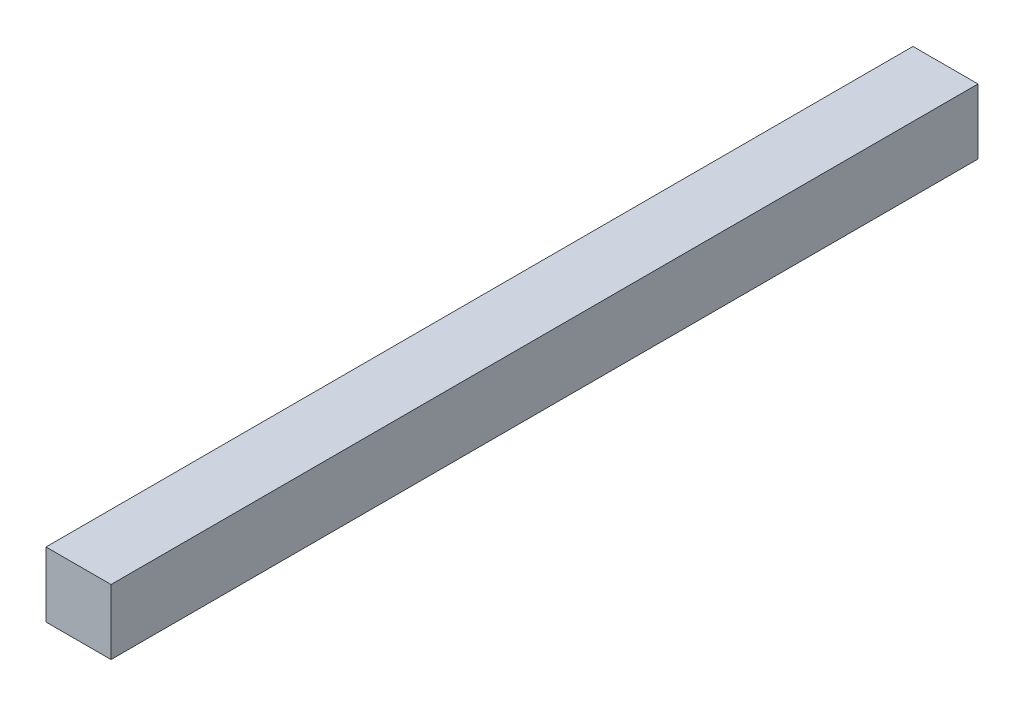
ISO-10303-21;
HEADER;
FILE_DESCRIPTION(('STEP AP214'),'2;1');
FILE_NAME('part.step','',(''),(''),'','','');
FILE_SCHEMA(('AUTOMOTIVE_DESIGN { 1 0 10303 214 1 1 1 1 }'));
ENDSEC;
DATA;
#1=APPLICATION_CONTEXT('core data for automotive mechanical design processes');
#2=APPLICATION_PROTOCOL_DEFINITION('international standard','automotive_design',2000,#1);
#3=PRODUCT_CONTEXT('',#1,'mechanical');
#4=PRODUCT('Part','Part','',(#3));
#5=PRODUCT_RELATED_PRODUCT_CATEGORY('part','',(#4));
#6=PRODUCT_DEFINITION_FORMATION('','',#4);
#7=PRODUCT_DEFINITION_CONTEXT('part definition',#1,'design');
#8=PRODUCT_DEFINITION('design','',#6,#7);
#9=PRODUCT_DEFINITION_SHAPE('','',#8);
#10=(LENGTH_UNIT() NAMED_UNIT(*) SI_UNIT(.MILLI.,.METRE.));
#11=(NAMED_UNIT(*) PLANE_ANGLE_UNIT() SI_UNIT($,.RADIAN.));
#12=(NAMED_UNIT(*) SI_UNIT($,.STERADIAN.) SOLID_ANGLE_UNIT());
#13=UNCERTAINTY_MEASURE_WITH_UNIT(LENGTH_MEASURE(1.E-05),#10,'distance_accuracy_value','');
#14=(GEOMETRIC_REPRESENTATION_CONTEXT(3) GLOBAL_UNCERTAINTY_ASSIGNED_CONTEXT((#13)) GLOBAL_UNIT_ASSIGNED_CONTEXT((#10,
#11,#12)) REPRESENTATION_CONTEXT('',''));
#15=CARTESIAN_POINT('',(0.,0.,0.));
#16=DIRECTION('',(0.,0.,1.));
#17=DIRECTION('',(1.,0.,0.));
#18=AXIS2_PLACEMENT_3D('',#15,#16,#17);
#19=CARTESIAN_POINT('',(64.6371308016878,-0.0100000000000031,7.15189873417722));
#20=DIRECTION('',(0.,0.,1.));
#21=DIRECTION('',(1.,0.,0.));
#22=AXIS2_PLACEMENT_3D('',#19,#20,#21);
#23=PLANE('',#22);
#24=DIRECTION('',(0.,1.,0.));
#25=VECTOR('',#24,1.);
#26=CARTESIAN_POINT('',(64.6371308016878,-0.0100000000000031,7.15189873417722));
#27=LINE('',#26,#25);
#28=CARTESIAN_POINT('',(64.6371308016878,0.,7.15189873417722));
#29=VERTEX_POINT('',#28);
#30=CARTESIAN_POINT('',(64.6371308016878,3.,7.15189873417722));
#31=VERTEX_POINT('',#30);
#32=EDGE_CURVE('E36',#29,#31,#27,.T.);
#33=ORIENTED_EDGE('',*,*,#32,.F.);
#34=DIRECTION('',(1.,0.,0.));
#35=VECTOR('',#34,1.);
#36=CARTESIAN_POINT('',(0.,0.,7.15189873417722));
#37=LINE('',#36,#35);
#38=CARTESIAN_POINT('',(67.6371308016878,0.,7.15189873417722));
#39=VERTEX_POINT('',#38);
#40=EDGE_CURVE('E87',#29,#39,#37,.T.);
#41=ORIENTED_EDGE('',*,*,#40,.T.);
#42=DIRECTION('',(0.,1.,0.));
#43=VECTOR('',#42,1.);
#44=CARTESIAN_POINT('',(67.6371308016878,-0.0100000000000031,7.15189873417722));
#45=LINE('',#44,#43);
#46=CARTESIAN_POINT('',(67.6371308016878,3.,7.15189873417722));
#47=VERTEX_POINT('',#46);
#48=EDGE_CURVE('E93',#39,#47,#45,.T.);
#49=ORIENTED_EDGE('',*,*,#48,.T.);
#50=DIRECTION('',(1.,0.,0.));
#51=VECTOR('',#50,1.);
#52=CARTESIAN_POINT('',(0.,3.,7.15189873417722));
#53=LINE('',#52,#51);
#54=EDGE_CURVE('E98',#31,#47,#53,.T.);
#55=ORIENTED_EDGE('',*,*,#54,.F.);
#56=EDGE_LOOP('',(#33,#41,#49,#55));
#57=FACE_BOUND('',#56,.T.);
#58=ADVANCED_FACE('F32',(#57),#23,.T.);
#59=CARTESIAN_POINT('',(64.6371308016878,-0.0100000000000031,-32.8481012658228));
#60=DIRECTION('',(0.,0.,-1.));
#61=DIRECTION('',(-1.,0.,0.));
#62=AXIS2_PLACEMENT_3D('',#59,#60,#61);
#63=PLANE('',#62);
#64=DIRECTION('',(0.,-1.,0.));
#65=VECTOR('',#64,1.);
#66=CARTESIAN_POINT('',(67.6371308016878,50.,-32.8481012658228));
#67=LINE('',#66,#65);
#68=CARTESIAN_POINT('',(67.6371308016878,3.,-32.8481012658228));
#69=VERTEX_POINT('',#68);
#70=CARTESIAN_POINT('',(67.6371308016878,0.,-32.8481012658228));
#71=VERTEX_POINT('',#70);
#72=EDGE_CURVE('E84',#69,#71,#67,.T.);
#73=ORIENTED_EDGE('',*,*,#72,.T.);
#74=DIRECTION('',(-1.,0.,0.));
#75=VECTOR('',#74,1.);
#76=CARTESIAN_POINT('',(0.,0.,-32.8481012658228));
#77=LINE('',#76,#75);
#78=CARTESIAN_POINT('',(64.6371308016878,0.,-32.8481012658228));
#79=VERTEX_POINT('',#78);
#80=EDGE_CURVE('E11',#71,#79,#77,.T.);
#81=ORIENTED_EDGE('',*,*,#80,.T.);
#82=DIRECTION('',(0.,1.,0.));
#83=VECTOR('',#82,1.);
#84=CARTESIAN_POINT('',(64.6371308016878,-0.0100000000000031,-32.8481012658228));
#85=LINE('',#84,#83);
#86=CARTESIAN_POINT('',(64.6371308016878,3.,-32.8481012658228));
#87=VERTEX_POINT('',#86);
#88=EDGE_CURVE('E75',#79,#87,#85,.T.);
#89=ORIENTED_EDGE('',*,*,#88,.T.);
#90=DIRECTION('',(-1.,0.,0.));
#91=VECTOR('',#90,1.);
#92=CARTESIAN_POINT('',(0.,3.,-32.8481012658228));
#93=LINE('',#92,#91);
#94=EDGE_CURVE('E94',#69,#87,#93,.T.);
#95=ORIENTED_EDGE('',*,*,#94,.F.);
#96=EDGE_LOOP('',(#73,#81,#89,#95));
#97=FACE_BOUND('',#96,.T.);
#98=ADVANCED_FACE('F83',(#97),#63,.T.);
#99=CARTESIAN_POINT('',(64.6371308016878,-0.0100000000000031,7.15189873417722));
#100=DIRECTION('',(-1.,0.,0.));
#101=DIRECTION('',(0.,0.,1.));
#102=AXIS2_PLACEMENT_3D('',#99,#100,#101);
#103=PLANE('',#102);
#104=ORIENTED_EDGE('',*,*,#88,.F.);
#105=DIRECTION('',(0.,0.,1.));
#106=VECTOR('',#105,1.);
#107=CARTESIAN_POINT('',(64.6371308016878,0.,0.));
#108=LINE('',#107,#106);
#109=EDGE_CURVE('E41',#79,#29,#108,.T.);
#110=ORIENTED_EDGE('',*,*,#109,.T.);
#111=ORIENTED_EDGE('',*,*,#32,.T.);
#112=DIRECTION('',(0.,0.,1.));
#113=VECTOR('',#112,1.);
#114=CARTESIAN_POINT('',(64.6371308016878,3.,0.));
#115=LINE('',#114,#113);
#116=EDGE_CURVE('E78',#87,#31,#115,.T.);
#117=ORIENTED_EDGE('',*,*,#116,.F.);
#118=EDGE_LOOP('',(#104,#110,#111,#117));
#119=FACE_BOUND('',#118,.T.);
#120=ADVANCED_FACE('F34',(#119),#103,.T.);
#121=CARTESIAN_POINT('',(0.,0.,0.));
#122=DIRECTION('',(0.,1.,0.));
#123=DIRECTION('',(0.,0.,1.));
#124=AXIS2_PLACEMENT_3D('',#121,#122,#123);
#125=PLANE('',#124);
#126=ORIENTED_EDGE('',*,*,#40,.F.);
#127=ORIENTED_EDGE('',*,*,#109,.F.);
#128=ORIENTED_EDGE('',*,*,#80,.F.);
#129=DIRECTION('',(0.,0.,-1.));
#130=VECTOR('',#129,1.);
#131=CARTESIAN_POINT('',(67.6371308016878,0.,-47.8481012658228));
#132=LINE('',#131,#130);
#133=EDGE_CURVE('E49',#39,#71,#132,.T.);
#134=ORIENTED_EDGE('',*,*,#133,.F.);
#135=EDGE_LOOP('',(#126,#127,#128,#134));
#136=FACE_BOUND('',#135,.T.);
#137=ADVANCED_FACE('F85',(#136),#125,.F.);
#138=CARTESIAN_POINT('',(67.6371308016878,50.,-47.8481012658228));
#139=DIRECTION('',(-1.,0.,0.));
#140=DIRECTION('',(0.,0.,1.));
#141=AXIS2_PLACEMENT_3D('',#138,#139,#140);
#142=PLANE('',#141);
#143=ORIENTED_EDGE('',*,*,#48,.F.);
#144=ORIENTED_EDGE('',*,*,#133,.T.);
#145=ORIENTED_EDGE('',*,*,#72,.F.);
#146=DIRECTION('',(0.,0.,1.));
#147=VECTOR('',#146,1.);
#148=CARTESIAN_POINT('',(67.6371308016878,3.,-47.8481012658228));
#149=LINE('',#148,#147);
#150=EDGE_CURVE('E96',#69,#47,#149,.T.);
#151=ORIENTED_EDGE('',*,*,#150,.T.);
#152=EDGE_LOOP('',(#143,#144,#145,#151));
#153=FACE_BOUND('',#152,.T.);
#154=ADVANCED_FACE('F103',(#153),#142,.F.);
#155=CARTESIAN_POINT('',(0.,3.,0.));
#156=DIRECTION('',(0.,1.,0.));
#157=DIRECTION('',(0.,0.,1.));
#158=AXIS2_PLACEMENT_3D('',#155,#156,#157);
#159=PLANE('',#158);
#160=ORIENTED_EDGE('',*,*,#116,.T.);
#161=ORIENTED_EDGE('',*,*,#54,.T.);
#162=ORIENTED_EDGE('',*,*,#150,.F.);
#163=ORIENTED_EDGE('',*,*,#94,.T.);
#164=EDGE_LOOP('',(#160,#161,#162,#163));
#165=FACE_BOUND('',#164,.T.);
#166=ADVANCED_FACE('F105',(#165),#159,.T.);
#167=CLOSED_SHELL('',(#58,#98,#120,#137,#154,#166));
#168=MANIFOLD_SOLID_BREP('B2',#167);
#169=ADVANCED_BREP_SHAPE_REPRESENTATION('',(#18,#168),#14);
#170=SHAPE_DEFINITION_REPRESENTATION(#9,#169);
ENDSEC;
END-ISO-10303-21;
